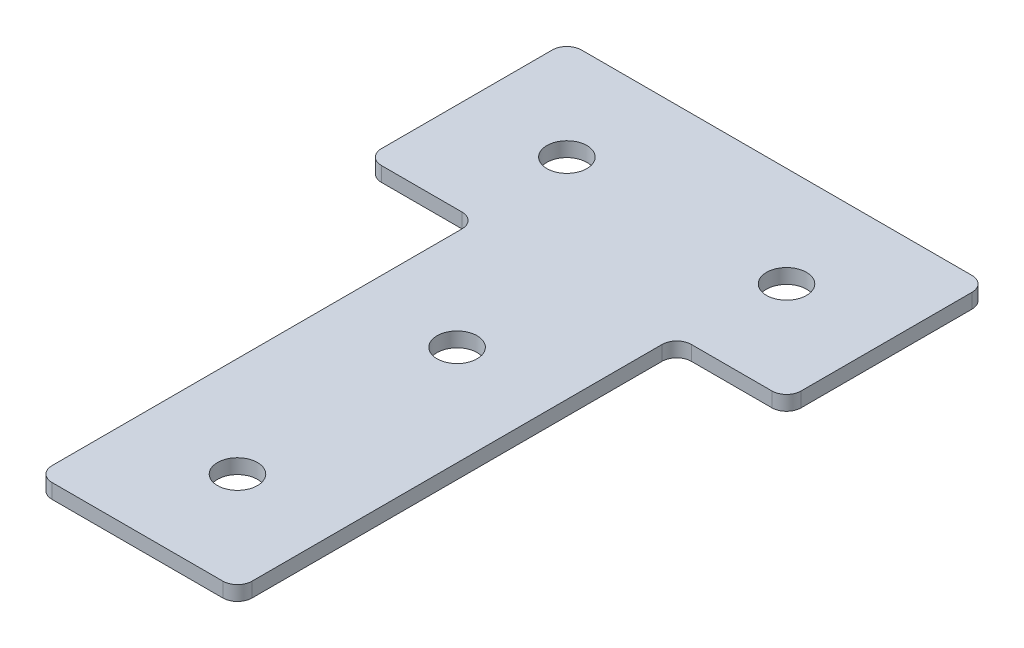
ISO-10303-21;
HEADER;
FILE_DESCRIPTION(('STEP AP214'),'2;1');
FILE_NAME('part.step','',(''),(''),'','','');
FILE_SCHEMA(('AUTOMOTIVE_DESIGN { 1 0 10303 214 1 1 1 1 }'));
ENDSEC;
DATA;
#1=APPLICATION_CONTEXT('core data for automotive mechanical design processes');
#2=APPLICATION_PROTOCOL_DEFINITION('international standard','automotive_design',2000,#1);
#3=PRODUCT_CONTEXT('',#1,'mechanical');
#4=PRODUCT('Part','Part','',(#3));
#5=PRODUCT_RELATED_PRODUCT_CATEGORY('part','',(#4));
#6=PRODUCT_DEFINITION_FORMATION('','',#4);
#7=PRODUCT_DEFINITION_CONTEXT('part definition',#1,'design');
#8=PRODUCT_DEFINITION('design','',#6,#7);
#9=PRODUCT_DEFINITION_SHAPE('','',#8);
#10=(LENGTH_UNIT() NAMED_UNIT(*) SI_UNIT(.MILLI.,.METRE.));
#11=(NAMED_UNIT(*) PLANE_ANGLE_UNIT() SI_UNIT($,.RADIAN.));
#12=(NAMED_UNIT(*) SI_UNIT($,.STERADIAN.) SOLID_ANGLE_UNIT());
#13=UNCERTAINTY_MEASURE_WITH_UNIT(LENGTH_MEASURE(1.E-05),#10,'distance_accuracy_value','');
#14=(GEOMETRIC_REPRESENTATION_CONTEXT(3) GLOBAL_UNCERTAINTY_ASSIGNED_CONTEXT((#13)) GLOBAL_UNIT_ASSIGNED_CONTEXT((#10,
#11,#12)) REPRESENTATION_CONTEXT('',''));
#15=CARTESIAN_POINT('',(0.,0.,0.));
#16=DIRECTION('',(0.,0.,1.));
#17=DIRECTION('',(1.,0.,0.));
#18=AXIS2_PLACEMENT_3D('',#15,#16,#17);
#19=CARTESIAN_POINT('',(-2.12462870860008,1.42462627726309,-45.7995222734962));
#20=DIRECTION('',(0.,-1.,0.));
#21=DIRECTION('',(0.,0.,-1.));
#22=AXIS2_PLACEMENT_3D('',#19,#20,#21);
#23=PLANE('',#22);
#24=CARTESIAN_POINT('',(-2.1246287086001,1.42462627726309,-0.799522273496195));
#25=DIRECTION('',(0.,1.,0.));
#26=DIRECTION('',(0.,0.,1.));
#27=AXIS2_PLACEMENT_3D('',#24,#25,#26);
#28=CIRCLE('',#27,4.1);
#29=CARTESIAN_POINT('',(-2.1246287086001,1.42462627726309,3.3004777265038));
#30=VERTEX_POINT('',#29);
#31=EDGE_CURVE('E207',#30,#30,#28,.T.);
#32=ORIENTED_EDGE('',*,*,#31,.T.);
#33=EDGE_LOOP('',(#32));
#34=FACE_BOUND('',#33,.T.);
#35=DIRECTION('',(1.,0.,0.));
#36=VECTOR('',#35,1.);
#37=CARTESIAN_POINT('',(-22.6246287086001,1.42462627726309,64.7004777265038));
#38=LINE('',#37,#36);
#39=CARTESIAN_POINT('',(-19.6246287086,1.42462627726309,64.7004777265038));
#40=VERTEX_POINT('',#39);
#41=CARTESIAN_POINT('',(15.3753712913999,1.42462627726309,64.7004777265038));
#42=VERTEX_POINT('',#41);
#43=EDGE_CURVE('E225',#40,#42,#38,.T.);
#44=ORIENTED_EDGE('',*,*,#43,.F.);
#45=CARTESIAN_POINT('',(-19.6246287086,1.42462627726309,61.7004777265038));
#46=DIRECTION('',(0.,1.,0.));
#47=DIRECTION('',(0.,0.,-1.));
#48=AXIS2_PLACEMENT_3D('',#45,#46,#47);
#49=CIRCLE('',#48,3.);
#50=CARTESIAN_POINT('',(-22.6246287086,1.42462627726309,61.7004777265038));
#51=VERTEX_POINT('',#50);
#52=EDGE_CURVE('E181',#51,#40,#49,.T.);
#53=ORIENTED_EDGE('',*,*,#52,.F.);
#54=DIRECTION('',(0.,0.,-1.));
#55=VECTOR('',#54,1.);
#56=CARTESIAN_POINT('',(-22.6246287086,1.42462627726309,64.7004777265038));
#57=LINE('',#56,#55);
#58=CARTESIAN_POINT('',(-22.6246287086001,1.42462627726309,-22.2995222734961));
#59=VERTEX_POINT('',#58);
#60=EDGE_CURVE('E296',#51,#59,#57,.T.);
#61=ORIENTED_EDGE('',*,*,#60,.T.);
#62=CARTESIAN_POINT('',(-25.6246287086001,1.42462627726309,-22.2995222734962));
#63=DIRECTION('',(0.,1.,0.));
#64=DIRECTION('',(0.,0.,-1.));
#65=AXIS2_PLACEMENT_3D('',#62,#63,#64);
#66=CIRCLE('',#65,3.);
#67=CARTESIAN_POINT('',(-25.6246287086001,1.42462627726309,-25.2995222734962));
#68=VERTEX_POINT('',#67);
#69=EDGE_CURVE('E197',#68,#59,#66,.F.);
#70=ORIENTED_EDGE('',*,*,#69,.F.);
#71=DIRECTION('',(-1.,0.,0.));
#72=VECTOR('',#71,1.);
#73=CARTESIAN_POINT('',(-22.6246287086001,1.42462627726309,-25.2995222734962));
#74=LINE('',#73,#72);
#75=CARTESIAN_POINT('',(-42.1246287086001,1.42462627726309,-25.2995222734962));
#76=VERTEX_POINT('',#75);
#77=EDGE_CURVE('E167',#68,#76,#74,.T.);
#78=ORIENTED_EDGE('',*,*,#77,.T.);
#79=CARTESIAN_POINT('',(-42.1246287086001,1.42462627726309,-28.2995222734962));
#80=DIRECTION('',(0.,1.,0.));
#81=DIRECTION('',(0.,0.,-1.));
#82=AXIS2_PLACEMENT_3D('',#79,#80,#81);
#83=CIRCLE('',#82,3.);
#84=CARTESIAN_POINT('',(-45.1246287086001,1.42462627726309,-28.2995222734962));
#85=VERTEX_POINT('',#84);
#86=EDGE_CURVE('E179',#85,#76,#83,.T.);
#87=ORIENTED_EDGE('',*,*,#86,.F.);
#88=DIRECTION('',(0.,0.,-1.));
#89=VECTOR('',#88,1.);
#90=CARTESIAN_POINT('',(-45.1246287086001,1.42462627726309,-25.2995222734962));
#91=LINE('',#90,#89);
#92=CARTESIAN_POINT('',(-45.1246287086001,1.42462627726309,-63.2995222734962));
#93=VERTEX_POINT('',#92);
#94=EDGE_CURVE('E147',#85,#93,#91,.T.);
#95=ORIENTED_EDGE('',*,*,#94,.T.);
#96=CARTESIAN_POINT('',(-42.1246287086001,1.42462627726309,-63.2995222734962));
#97=DIRECTION('',(0.,1.,0.));
#98=DIRECTION('',(0.,0.,-1.));
#99=AXIS2_PLACEMENT_3D('',#96,#97,#98);
#100=CIRCLE('',#99,3.);
#101=CARTESIAN_POINT('',(-42.1246287086001,1.42462627726309,-66.2995222734962));
#102=VERTEX_POINT('',#101);
#103=EDGE_CURVE('E176',#102,#93,#100,.T.);
#104=ORIENTED_EDGE('',*,*,#103,.F.);
#105=DIRECTION('',(-1.,0.,0.));
#106=VECTOR('',#105,1.);
#107=CARTESIAN_POINT('',(40.8753712913999,1.42462627726309,-66.2995222734962));
#108=LINE('',#107,#106);
#109=CARTESIAN_POINT('',(37.8753712913999,1.42462627726309,-66.2995222734962));
#110=VERTEX_POINT('',#109);
#111=EDGE_CURVE('E222',#110,#102,#108,.T.);
#112=ORIENTED_EDGE('',*,*,#111,.F.);
#113=CARTESIAN_POINT('',(37.8753712913999,1.42462627726309,-63.2995222734962));
#114=DIRECTION('',(0.,-1.,0.));
#115=DIRECTION('',(0.,0.,-1.));
#116=AXIS2_PLACEMENT_3D('',#113,#114,#115);
#117=CIRCLE('',#116,3.);
#118=CARTESIAN_POINT('',(40.8753712913999,1.42462627726309,-63.2995222734962));
#119=VERTEX_POINT('',#118);
#120=EDGE_CURVE('E252',#110,#119,#117,.T.);
#121=ORIENTED_EDGE('',*,*,#120,.T.);
#122=DIRECTION('',(0.,0.,-1.));
#123=VECTOR('',#122,1.);
#124=CARTESIAN_POINT('',(40.8753712913999,1.42462627726309,-25.2995222734962));
#125=LINE('',#124,#123);
#126=CARTESIAN_POINT('',(40.8753712913999,1.42462627726309,-28.2995222734962));
#127=VERTEX_POINT('',#126);
#128=EDGE_CURVE('E219',#127,#119,#125,.T.);
#129=ORIENTED_EDGE('',*,*,#128,.F.);
#130=CARTESIAN_POINT('',(37.8753712913999,1.42462627726309,-28.2995222734962));
#131=DIRECTION('',(0.,-1.,0.));
#132=DIRECTION('',(0.,0.,-1.));
#133=AXIS2_PLACEMENT_3D('',#130,#131,#132);
#134=CIRCLE('',#133,3.);
#135=CARTESIAN_POINT('',(37.8753712913999,1.42462627726309,-25.2995222734962));
#136=VERTEX_POINT('',#135);
#137=EDGE_CURVE('E254',#127,#136,#134,.T.);
#138=ORIENTED_EDGE('',*,*,#137,.T.);
#139=DIRECTION('',(1.,0.,0.));
#140=VECTOR('',#139,1.);
#141=CARTESIAN_POINT('',(18.3753712913999,1.42462627726309,-25.2995222734962));
#142=LINE('',#141,#140);
#143=CARTESIAN_POINT('',(21.3753712913999,1.42462627726309,-25.2995222734962));
#144=VERTEX_POINT('',#143);
#145=EDGE_CURVE('E229',#144,#136,#142,.T.);
#146=ORIENTED_EDGE('',*,*,#145,.F.);
#147=CARTESIAN_POINT('',(21.3753712913999,1.42462627726309,-22.2995222734962));
#148=DIRECTION('',(0.,-1.,0.));
#149=DIRECTION('',(0.,0.,-1.));
#150=AXIS2_PLACEMENT_3D('',#147,#148,#149);
#151=CIRCLE('',#150,3.);
#152=CARTESIAN_POINT('',(18.3753712913999,1.42462627726309,-22.2995222734961));
#153=VERTEX_POINT('',#152);
#154=EDGE_CURVE('E10',#144,#153,#151,.F.);
#155=ORIENTED_EDGE('',*,*,#154,.T.);
#156=DIRECTION('',(0.,0.,-1.));
#157=VECTOR('',#156,1.);
#158=CARTESIAN_POINT('',(18.3753712913999,1.42462627726309,64.7004777265038));
#159=LINE('',#158,#157);
#160=CARTESIAN_POINT('',(18.3753712913999,1.42462627726309,61.7004777265038));
#161=VERTEX_POINT('',#160);
#162=EDGE_CURVE('E227',#161,#153,#159,.T.);
#163=ORIENTED_EDGE('',*,*,#162,.F.);
#164=CARTESIAN_POINT('',(15.3753712913999,1.42462627726309,61.7004777265038));
#165=DIRECTION('',(0.,-1.,0.));
#166=DIRECTION('',(0.,0.,-1.));
#167=AXIS2_PLACEMENT_3D('',#164,#165,#166);
#168=CIRCLE('',#167,3.);
#169=EDGE_CURVE('E256',#161,#42,#168,.T.);
#170=ORIENTED_EDGE('',*,*,#169,.T.);
#171=EDGE_LOOP('',(#44,#53,#61,#70,#78,#87,#95,#104,#112,#121,#129,#138,#146,#155,#163,#170));
#172=FACE_BOUND('',#171,.T.);
#173=CARTESIAN_POINT('',(-2.1246287086001,1.42462627726309,44.2004777265038));
#174=DIRECTION('',(0.,1.,0.));
#175=DIRECTION('',(0.,0.,1.));
#176=AXIS2_PLACEMENT_3D('',#173,#174,#175);
#177=CIRCLE('',#176,4.1);
#178=CARTESIAN_POINT('',(-2.1246287086001,1.42462627726309,48.3004777265038));
#179=VERTEX_POINT('',#178);
#180=EDGE_CURVE('E201',#179,#179,#177,.T.);
#181=ORIENTED_EDGE('',*,*,#180,.T.);
#182=EDGE_LOOP('',(#181));
#183=FACE_BOUND('',#182,.T.);
#184=CARTESIAN_POINT('',(20.3753712913999,1.42462627726309,-45.7995222734962));
#185=DIRECTION('',(0.,1.,0.));
#186=DIRECTION('',(0.,0.,1.));
#187=AXIS2_PLACEMENT_3D('',#184,#185,#186);
#188=CIRCLE('',#187,4.1);
#189=CARTESIAN_POINT('',(20.3753712913999,1.42462627726309,-41.6995222734962));
#190=VERTEX_POINT('',#189);
#191=EDGE_CURVE('E213',#190,#190,#188,.T.);
#192=ORIENTED_EDGE('',*,*,#191,.T.);
#193=EDGE_LOOP('',(#192));
#194=FACE_BOUND('',#193,.T.);
#195=CARTESIAN_POINT('',(-24.6246287086001,1.42462627726309,-45.7995222734962));
#196=DIRECTION('',(0.,-1.,0.));
#197=DIRECTION('',(0.,0.,1.));
#198=AXIS2_PLACEMENT_3D('',#195,#196,#197);
#199=CIRCLE('',#198,4.1);
#200=CARTESIAN_POINT('',(-24.6246287086001,1.42462627726309,-41.6995222734962));
#201=VERTEX_POINT('',#200);
#202=EDGE_CURVE('E158',#201,#201,#199,.T.);
#203=ORIENTED_EDGE('',*,*,#202,.F.);
#204=EDGE_LOOP('',(#203));
#205=FACE_BOUND('',#204,.T.);
#206=ADVANCED_FACE('F16',(#34,#172,#183,#194,#205),#23,.T.);
#207=CARTESIAN_POINT('',(40.8753712913999,1.42462627726309,-25.2995222734962));
#208=DIRECTION('',(1.,0.,0.));
#209=DIRECTION('',(0.,0.,-1.));
#210=AXIS2_PLACEMENT_3D('',#207,#208,#209);
#211=PLANE('',#210);
#212=DIRECTION('',(0.,0.,-1.));
#213=VECTOR('',#212,1.);
#214=CARTESIAN_POINT('',(40.8753712913999,4.42462627726309,-25.2995222734962));
#215=LINE('',#214,#213);
#216=CARTESIAN_POINT('',(40.8753712913999,4.42462627726309,-28.2995222734962));
#217=VERTEX_POINT('',#216);
#218=CARTESIAN_POINT('',(40.8753712913999,4.42462627726309,-63.2995222734962));
#219=VERTEX_POINT('',#218);
#220=EDGE_CURVE('E216',#217,#219,#215,.T.);
#221=ORIENTED_EDGE('',*,*,#220,.F.);
#222=DIRECTION('',(0.,1.,0.));
#223=VECTOR('',#222,1.);
#224=CARTESIAN_POINT('',(40.8753712913999,1.42462627726309,-28.2995222734962));
#225=LINE('',#224,#223);
#226=EDGE_CURVE('E271',#217,#127,#225,.F.);
#227=ORIENTED_EDGE('',*,*,#226,.T.);
#228=ORIENTED_EDGE('',*,*,#128,.T.);
#229=DIRECTION('',(0.,1.,0.));
#230=VECTOR('',#229,1.);
#231=CARTESIAN_POINT('',(40.8753712913999,1.42462627726309,-63.2995222734962));
#232=LINE('',#231,#230);
#233=EDGE_CURVE('E268',#119,#219,#232,.T.);
#234=ORIENTED_EDGE('',*,*,#233,.T.);
#235=EDGE_LOOP('',(#221,#227,#228,#234));
#236=FACE_BOUND('',#235,.T.);
#237=ADVANCED_FACE('F323',(#236),#211,.T.);
#238=CARTESIAN_POINT('',(18.3753712913999,1.42462627726309,-25.2995222734962));
#239=DIRECTION('',(0.,0.,1.));
#240=DIRECTION('',(1.,0.,0.));
#241=AXIS2_PLACEMENT_3D('',#238,#239,#240);
#242=PLANE('',#241);
#243=DIRECTION('',(1.,0.,0.));
#244=VECTOR('',#243,1.);
#245=CARTESIAN_POINT('',(18.3753712913999,4.42462627726309,-25.2995222734962));
#246=LINE('',#245,#244);
#247=CARTESIAN_POINT('',(21.3753712913999,4.42462627726309,-25.2995222734962));
#248=VERTEX_POINT('',#247);
#249=CARTESIAN_POINT('',(37.8753712913999,4.42462627726309,-25.2995222734962));
#250=VERTEX_POINT('',#249);
#251=EDGE_CURVE('E223',#248,#250,#246,.T.);
#252=ORIENTED_EDGE('',*,*,#251,.F.);
#253=DIRECTION('',(0.,1.,0.));
#254=VECTOR('',#253,1.);
#255=CARTESIAN_POINT('',(21.3753712913999,1.42462627726309,-25.2995222734962));
#256=LINE('',#255,#254);
#257=EDGE_CURVE('E266',#248,#144,#256,.F.);
#258=ORIENTED_EDGE('',*,*,#257,.T.);
#259=ORIENTED_EDGE('',*,*,#145,.T.);
#260=DIRECTION('',(0.,1.,0.));
#261=VECTOR('',#260,1.);
#262=CARTESIAN_POINT('',(37.8753712913999,1.42462627726309,-25.2995222734962));
#263=LINE('',#262,#261);
#264=EDGE_CURVE('E263',#136,#250,#263,.T.);
#265=ORIENTED_EDGE('',*,*,#264,.T.);
#266=EDGE_LOOP('',(#252,#258,#259,#265));
#267=FACE_BOUND('',#266,.T.);
#268=ADVANCED_FACE('F279',(#267),#242,.T.);
#269=CARTESIAN_POINT('',(18.3753712913999,1.42462627726309,64.7004777265038));
#270=DIRECTION('',(1.,0.,0.));
#271=DIRECTION('',(0.,0.,-1.));
#272=AXIS2_PLACEMENT_3D('',#269,#270,#271);
#273=PLANE('',#272);
#274=DIRECTION('',(0.,0.,-1.));
#275=VECTOR('',#274,1.);
#276=CARTESIAN_POINT('',(18.3753712913999,4.42462627726309,64.7004777265038));
#277=LINE('',#276,#275);
#278=CARTESIAN_POINT('',(18.3753712913999,4.42462627726309,61.7004777265038));
#279=VERTEX_POINT('',#278);
#280=CARTESIAN_POINT('',(18.3753712913999,4.42462627726309,-22.2995222734961));
#281=VERTEX_POINT('',#280);
#282=EDGE_CURVE('E239',#279,#281,#277,.T.);
#283=ORIENTED_EDGE('',*,*,#282,.F.);
#284=DIRECTION('',(0.,1.,0.));
#285=VECTOR('',#284,1.);
#286=CARTESIAN_POINT('',(18.3753712913999,1.42462627726309,61.7004777265038));
#287=LINE('',#286,#285);
#288=EDGE_CURVE('E36',#279,#161,#287,.F.);
#289=ORIENTED_EDGE('',*,*,#288,.T.);
#290=ORIENTED_EDGE('',*,*,#162,.T.);
#291=DIRECTION('',(0.,1.,0.));
#292=VECTOR('',#291,1.);
#293=CARTESIAN_POINT('',(18.3753712913999,4.42462627726309,-22.2995222734962));
#294=LINE('',#293,#292);
#295=EDGE_CURVE('E259',#153,#281,#294,.T.);
#296=ORIENTED_EDGE('',*,*,#295,.T.);
#297=EDGE_LOOP('',(#283,#289,#290,#296));
#298=FACE_BOUND('',#297,.T.);
#299=ADVANCED_FACE('F282',(#298),#273,.T.);
#300=CARTESIAN_POINT('',(-22.6246287086001,1.42462627726309,64.7004777265038));
#301=DIRECTION('',(0.,0.,1.));
#302=DIRECTION('',(1.,0.,0.));
#303=AXIS2_PLACEMENT_3D('',#300,#301,#302);
#304=PLANE('',#303);
#305=DIRECTION('',(1.,0.,0.));
#306=VECTOR('',#305,1.);
#307=CARTESIAN_POINT('',(-22.6246287086001,4.42462627726309,64.7004777265038));
#308=LINE('',#307,#306);
#309=CARTESIAN_POINT('',(-19.6246287086,4.42462627726309,64.7004777265038));
#310=VERTEX_POINT('',#309);
#311=CARTESIAN_POINT('',(15.3753712913999,4.42462627726309,64.7004777265038));
#312=VERTEX_POINT('',#311);
#313=EDGE_CURVE('E237',#310,#312,#308,.T.);
#314=ORIENTED_EDGE('',*,*,#313,.F.);
#315=DIRECTION('',(0.,1.,0.));
#316=VECTOR('',#315,1.);
#317=CARTESIAN_POINT('',(-19.6246287086,1.42462627726309,64.7004777265038));
#318=LINE('',#317,#316);
#319=EDGE_CURVE('E173',#40,#310,#318,.T.);
#320=ORIENTED_EDGE('',*,*,#319,.F.);
#321=ORIENTED_EDGE('',*,*,#43,.T.);
#322=DIRECTION('',(0.,1.,0.));
#323=VECTOR('',#322,1.);
#324=CARTESIAN_POINT('',(15.3753712913999,1.42462627726309,64.7004777265038));
#325=LINE('',#324,#323);
#326=EDGE_CURVE('E249',#42,#312,#325,.T.);
#327=ORIENTED_EDGE('',*,*,#326,.T.);
#328=EDGE_LOOP('',(#314,#320,#321,#327));
#329=FACE_BOUND('',#328,.T.);
#330=ADVANCED_FACE('F290',(#329),#304,.T.);
#331=CARTESIAN_POINT('',(40.8753712913999,1.42462627726309,-66.2995222734962));
#332=DIRECTION('',(0.,0.,-1.));
#333=DIRECTION('',(-1.,0.,0.));
#334=AXIS2_PLACEMENT_3D('',#331,#332,#333);
#335=PLANE('',#334);
#336=ORIENTED_EDGE('',*,*,#111,.T.);
#337=DIRECTION('',(0.,1.,0.));
#338=VECTOR('',#337,1.);
#339=CARTESIAN_POINT('',(-42.1246287086001,1.42462627726309,-66.2995222734962));
#340=LINE('',#339,#338);
#341=CARTESIAN_POINT('',(-42.1246287086001,4.42462627726309,-66.2995222734962));
#342=VERTEX_POINT('',#341);
#343=EDGE_CURVE('E149',#342,#102,#340,.F.);
#344=ORIENTED_EDGE('',*,*,#343,.F.);
#345=DIRECTION('',(-1.,0.,0.));
#346=VECTOR('',#345,1.);
#347=CARTESIAN_POINT('',(40.8753712913999,4.42462627726309,-66.2995222734962));
#348=LINE('',#347,#346);
#349=CARTESIAN_POINT('',(37.8753712913999,4.42462627726309,-66.2995222734962));
#350=VERTEX_POINT('',#349);
#351=EDGE_CURVE('E235',#350,#342,#348,.T.);
#352=ORIENTED_EDGE('',*,*,#351,.F.);
#353=DIRECTION('',(0.,1.,0.));
#354=VECTOR('',#353,1.);
#355=CARTESIAN_POINT('',(37.8753712913999,1.42462627726309,-66.2995222734962));
#356=LINE('',#355,#354);
#357=EDGE_CURVE('E273',#350,#110,#356,.F.);
#358=ORIENTED_EDGE('',*,*,#357,.T.);
#359=EDGE_LOOP('',(#336,#344,#352,#358));
#360=FACE_BOUND('',#359,.T.);
#361=ADVANCED_FACE('F355',(#360),#335,.T.);
#362=CARTESIAN_POINT('',(-2.12462870860008,4.42462627726309,-45.7995222734962));
#363=DIRECTION('',(0.,-1.,0.));
#364=DIRECTION('',(0.,0.,-1.));
#365=AXIS2_PLACEMENT_3D('',#362,#363,#364);
#366=PLANE('',#365);
#367=CARTESIAN_POINT('',(-2.1246287086001,4.42462627726309,-0.799522273496195));
#368=DIRECTION('',(0.,1.,0.));
#369=DIRECTION('',(0.,0.,1.));
#370=AXIS2_PLACEMENT_3D('',#367,#368,#369);
#371=CIRCLE('',#370,4.1);
#372=CARTESIAN_POINT('',(-2.1246287086001,4.42462627726309,3.3004777265038));
#373=VERTEX_POINT('',#372);
#374=EDGE_CURVE('E204',#373,#373,#371,.T.);
#375=ORIENTED_EDGE('',*,*,#374,.F.);
#376=EDGE_LOOP('',(#375));
#377=FACE_BOUND('',#376,.T.);
#378=CARTESIAN_POINT('',(-19.6246287086,4.42462627726309,61.7004777265038));
#379=DIRECTION('',(0.,1.,0.));
#380=DIRECTION('',(0.,0.,-1.));
#381=AXIS2_PLACEMENT_3D('',#378,#379,#380);
#382=CIRCLE('',#381,3.);
#383=CARTESIAN_POINT('',(-22.6246287086,4.42462627726309,61.7004777265038));
#384=VERTEX_POINT('',#383);
#385=EDGE_CURVE('E139',#310,#384,#382,.F.);
#386=ORIENTED_EDGE('',*,*,#385,.F.);
#387=ORIENTED_EDGE('',*,*,#313,.T.);
#388=CARTESIAN_POINT('',(15.3753712913999,4.42462627726309,61.7004777265038));
#389=DIRECTION('',(0.,-1.,0.));
#390=DIRECTION('',(0.,0.,-1.));
#391=AXIS2_PLACEMENT_3D('',#388,#389,#390);
#392=CIRCLE('',#391,3.);
#393=EDGE_CURVE('E247',#312,#279,#392,.F.);
#394=ORIENTED_EDGE('',*,*,#393,.T.);
#395=ORIENTED_EDGE('',*,*,#282,.T.);
#396=CARTESIAN_POINT('',(21.3753712913999,4.42462627726309,-22.2995222734962));
#397=DIRECTION('',(0.,-1.,0.));
#398=DIRECTION('',(0.,0.,-1.));
#399=AXIS2_PLACEMENT_3D('',#396,#397,#398);
#400=CIRCLE('',#399,3.);
#401=EDGE_CURVE('E24',#281,#248,#400,.T.);
#402=ORIENTED_EDGE('',*,*,#401,.T.);
#403=ORIENTED_EDGE('',*,*,#251,.T.);
#404=CARTESIAN_POINT('',(37.8753712913999,4.42462627726309,-28.2995222734962));
#405=DIRECTION('',(0.,-1.,0.));
#406=DIRECTION('',(0.,0.,-1.));
#407=AXIS2_PLACEMENT_3D('',#404,#405,#406);
#408=CIRCLE('',#407,3.);
#409=EDGE_CURVE('E245',#250,#217,#408,.F.);
#410=ORIENTED_EDGE('',*,*,#409,.T.);
#411=ORIENTED_EDGE('',*,*,#220,.T.);
#412=CARTESIAN_POINT('',(37.8753712913999,4.42462627726309,-63.2995222734962));
#413=DIRECTION('',(0.,-1.,0.));
#414=DIRECTION('',(0.,0.,-1.));
#415=AXIS2_PLACEMENT_3D('',#412,#413,#414);
#416=CIRCLE('',#415,3.);
#417=EDGE_CURVE('E232',#219,#350,#416,.F.);
#418=ORIENTED_EDGE('',*,*,#417,.T.);
#419=ORIENTED_EDGE('',*,*,#351,.T.);
#420=CARTESIAN_POINT('',(-42.1246287086001,4.42462627726309,-63.2995222734962));
#421=DIRECTION('',(0.,1.,0.));
#422=DIRECTION('',(0.,0.,-1.));
#423=AXIS2_PLACEMENT_3D('',#420,#421,#422);
#424=CIRCLE('',#423,3.);
#425=CARTESIAN_POINT('',(-45.1246287086001,4.42462627726309,-63.2995222734962));
#426=VERTEX_POINT('',#425);
#427=EDGE_CURVE('E140',#426,#342,#424,.F.);
#428=ORIENTED_EDGE('',*,*,#427,.F.);
#429=DIRECTION('',(0.,0.,-1.));
#430=VECTOR('',#429,1.);
#431=CARTESIAN_POINT('',(-45.1246287086001,4.42462627726309,-25.2995222734962));
#432=LINE('',#431,#430);
#433=CARTESIAN_POINT('',(-45.1246287086001,4.42462627726309,-28.2995222734962));
#434=VERTEX_POINT('',#433);
#435=EDGE_CURVE('E145',#434,#426,#432,.T.);
#436=ORIENTED_EDGE('',*,*,#435,.F.);
#437=CARTESIAN_POINT('',(-42.1246287086001,4.42462627726309,-28.2995222734962));
#438=DIRECTION('',(0.,1.,0.));
#439=DIRECTION('',(0.,0.,-1.));
#440=AXIS2_PLACEMENT_3D('',#437,#438,#439);
#441=CIRCLE('',#440,3.);
#442=CARTESIAN_POINT('',(-42.1246287086001,4.42462627726309,-25.2995222734962));
#443=VERTEX_POINT('',#442);
#444=EDGE_CURVE('E128',#443,#434,#441,.F.);
#445=ORIENTED_EDGE('',*,*,#444,.F.);
#446=DIRECTION('',(-1.,0.,0.));
#447=VECTOR('',#446,1.);
#448=CARTESIAN_POINT('',(-22.6246287086001,4.42462627726309,-25.2995222734962));
#449=LINE('',#448,#447);
#450=CARTESIAN_POINT('',(-25.6246287086001,4.42462627726309,-25.2995222734962));
#451=VERTEX_POINT('',#450);
#452=EDGE_CURVE('E161',#451,#443,#449,.T.);
#453=ORIENTED_EDGE('',*,*,#452,.F.);
#454=CARTESIAN_POINT('',(-25.6246287086001,4.42462627726309,-22.2995222734962));
#455=DIRECTION('',(0.,1.,0.));
#456=DIRECTION('',(0.,0.,-1.));
#457=AXIS2_PLACEMENT_3D('',#454,#455,#456);
#458=CIRCLE('',#457,3.);
#459=CARTESIAN_POINT('',(-22.6246287086001,4.42462627726309,-22.2995222734961));
#460=VERTEX_POINT('',#459);
#461=EDGE_CURVE('E195',#460,#451,#458,.T.);
#462=ORIENTED_EDGE('',*,*,#461,.F.);
#463=DIRECTION('',(0.,0.,-1.));
#464=VECTOR('',#463,1.);
#465=CARTESIAN_POINT('',(-22.6246287086,4.42462627726309,64.7004777265038));
#466=LINE('',#465,#464);
#467=EDGE_CURVE('E157',#384,#460,#466,.T.);
#468=ORIENTED_EDGE('',*,*,#467,.F.);
#469=EDGE_LOOP('',(#386,#387,#394,#395,#402,#403,#410,#411,#418,#419,#428,#436,#445,#453,#462,#468));
#470=FACE_BOUND('',#469,.T.);
#471=CARTESIAN_POINT('',(-2.1246287086001,4.42462627726309,44.2004777265038));
#472=DIRECTION('',(0.,1.,0.));
#473=DIRECTION('',(0.,0.,1.));
#474=AXIS2_PLACEMENT_3D('',#471,#472,#473);
#475=CIRCLE('',#474,4.1);
#476=CARTESIAN_POINT('',(-2.1246287086001,4.42462627726309,48.3004777265038));
#477=VERTEX_POINT('',#476);
#478=EDGE_CURVE('E200',#477,#477,#475,.T.);
#479=ORIENTED_EDGE('',*,*,#478,.F.);
#480=EDGE_LOOP('',(#479));
#481=FACE_BOUND('',#480,.T.);
#482=CARTESIAN_POINT('',(20.3753712913999,4.42462627726309,-45.7995222734962));
#483=DIRECTION('',(0.,1.,0.));
#484=DIRECTION('',(0.,0.,1.));
#485=AXIS2_PLACEMENT_3D('',#482,#483,#484);
#486=CIRCLE('',#485,4.1);
#487=CARTESIAN_POINT('',(20.3753712913999,4.42462627726309,-41.6995222734962));
#488=VERTEX_POINT('',#487);
#489=EDGE_CURVE('E210',#488,#488,#486,.T.);
#490=ORIENTED_EDGE('',*,*,#489,.F.);
#491=EDGE_LOOP('',(#490));
#492=FACE_BOUND('',#491,.T.);
#493=CARTESIAN_POINT('',(-24.6246287086001,4.42462627726309,-45.7995222734962));
#494=DIRECTION('',(0.,-1.,0.));
#495=DIRECTION('',(0.,0.,1.));
#496=AXIS2_PLACEMENT_3D('',#493,#494,#495);
#497=CIRCLE('',#496,4.1);
#498=CARTESIAN_POINT('',(-24.6246287086001,4.42462627726309,-41.6995222734962));
#499=VERTEX_POINT('',#498);
#500=EDGE_CURVE('E164',#499,#499,#497,.T.);
#501=ORIENTED_EDGE('',*,*,#500,.T.);
#502=EDGE_LOOP('',(#501));
#503=FACE_BOUND('',#502,.T.);
#504=ADVANCED_FACE('F153',(#377,#470,#481,#492,#503),#366,.F.);
#505=CARTESIAN_POINT('',(15.3753712913999,1.42462627726309,61.7004777265038));
#506=DIRECTION('',(0.,1.,0.));
#507=DIRECTION('',(0.,0.,1.));
#508=AXIS2_PLACEMENT_3D('',#505,#506,#507);
#509=CYLINDRICAL_SURFACE('',#508,3.);
#510=ORIENTED_EDGE('',*,*,#169,.F.);
#511=ORIENTED_EDGE('',*,*,#288,.F.);
#512=ORIENTED_EDGE('',*,*,#393,.F.);
#513=ORIENTED_EDGE('',*,*,#326,.F.);
#514=EDGE_LOOP('',(#510,#511,#512,#513));
#515=FACE_BOUND('',#514,.T.);
#516=ADVANCED_FACE('F287',(#515),#509,.T.);
#517=CARTESIAN_POINT('',(21.3753712913999,1.42462627726309,-22.2995222734962));
#518=DIRECTION('',(0.,-1.,0.));
#519=DIRECTION('',(0.,0.,-1.));
#520=AXIS2_PLACEMENT_3D('',#517,#518,#519);
#521=CYLINDRICAL_SURFACE('',#520,3.);
#522=ORIENTED_EDGE('',*,*,#154,.F.);
#523=ORIENTED_EDGE('',*,*,#257,.F.);
#524=ORIENTED_EDGE('',*,*,#401,.F.);
#525=ORIENTED_EDGE('',*,*,#295,.F.);
#526=EDGE_LOOP('',(#522,#523,#524,#525));
#527=FACE_BOUND('',#526,.T.);
#528=ADVANCED_FACE('F281',(#527),#521,.F.);
#529=CARTESIAN_POINT('',(37.8753712913999,1.42462627726309,-28.2995222734962));
#530=DIRECTION('',(0.,1.,0.));
#531=DIRECTION('',(0.,0.,1.));
#532=AXIS2_PLACEMENT_3D('',#529,#530,#531);
#533=CYLINDRICAL_SURFACE('',#532,3.);
#534=ORIENTED_EDGE('',*,*,#137,.F.);
#535=ORIENTED_EDGE('',*,*,#226,.F.);
#536=ORIENTED_EDGE('',*,*,#409,.F.);
#537=ORIENTED_EDGE('',*,*,#264,.F.);
#538=EDGE_LOOP('',(#534,#535,#536,#537));
#539=FACE_BOUND('',#538,.T.);
#540=ADVANCED_FACE('F336',(#539),#533,.T.);
#541=CARTESIAN_POINT('',(37.8753712913999,1.42462627726309,-63.2995222734962));
#542=DIRECTION('',(0.,1.,0.));
#543=DIRECTION('',(0.,0.,1.));
#544=AXIS2_PLACEMENT_3D('',#541,#542,#543);
#545=CYLINDRICAL_SURFACE('',#544,3.);
#546=ORIENTED_EDGE('',*,*,#120,.F.);
#547=ORIENTED_EDGE('',*,*,#357,.F.);
#548=ORIENTED_EDGE('',*,*,#417,.F.);
#549=ORIENTED_EDGE('',*,*,#233,.F.);
#550=EDGE_LOOP('',(#546,#547,#548,#549));
#551=FACE_BOUND('',#550,.T.);
#552=ADVANCED_FACE('F18',(#551),#545,.T.);
#553=CARTESIAN_POINT('',(20.3753712913999,1.42462627726309,-45.7995222734962));
#554=DIRECTION('',(0.,1.,0.));
#555=DIRECTION('',(0.,0.,1.));
#556=AXIS2_PLACEMENT_3D('',#553,#554,#555);
#557=CYLINDRICAL_SURFACE('',#556,4.1);
#558=ORIENTED_EDGE('',*,*,#191,.F.);
#559=EDGE_LOOP('',(#558));
#560=FACE_BOUND('',#559,.T.);
#561=ORIENTED_EDGE('',*,*,#489,.T.);
#562=EDGE_LOOP('',(#561));
#563=FACE_BOUND('',#562,.T.);
#564=ADVANCED_FACE('F342',(#560,#563),#557,.F.);
#565=CARTESIAN_POINT('',(-2.1246287086001,1.42462627726309,-0.799522273496195));
#566=DIRECTION('',(0.,1.,0.));
#567=DIRECTION('',(0.,0.,1.));
#568=AXIS2_PLACEMENT_3D('',#565,#566,#567);
#569=CYLINDRICAL_SURFACE('',#568,4.1);
#570=ORIENTED_EDGE('',*,*,#31,.F.);
#571=EDGE_LOOP('',(#570));
#572=FACE_BOUND('',#571,.T.);
#573=ORIENTED_EDGE('',*,*,#374,.T.);
#574=EDGE_LOOP('',(#573));
#575=FACE_BOUND('',#574,.T.);
#576=ADVANCED_FACE('F376',(#572,#575),#569,.F.);
#577=CARTESIAN_POINT('',(-2.1246287086001,1.42462627726309,44.2004777265038));
#578=DIRECTION('',(0.,1.,0.));
#579=DIRECTION('',(0.,0.,1.));
#580=AXIS2_PLACEMENT_3D('',#577,#578,#579);
#581=CYLINDRICAL_SURFACE('',#580,4.1);
#582=ORIENTED_EDGE('',*,*,#478,.T.);
#583=EDGE_LOOP('',(#582));
#584=FACE_BOUND('',#583,.T.);
#585=ORIENTED_EDGE('',*,*,#180,.F.);
#586=EDGE_LOOP('',(#585));
#587=FACE_BOUND('',#586,.T.);
#588=ADVANCED_FACE('F373',(#584,#587),#581,.F.);
#589=CARTESIAN_POINT('',(-45.1246287086001,1.42462627726309,-25.2995222734962));
#590=DIRECTION('',(-1.,0.,0.));
#591=DIRECTION('',(0.,0.,-1.));
#592=AXIS2_PLACEMENT_3D('',#589,#590,#591);
#593=PLANE('',#592);
#594=ORIENTED_EDGE('',*,*,#435,.T.);
#595=DIRECTION('',(0.,1.,0.));
#596=VECTOR('',#595,1.);
#597=CARTESIAN_POINT('',(-45.1246287086001,1.42462627726309,-63.2995222734962));
#598=LINE('',#597,#596);
#599=EDGE_CURVE('E150',#93,#426,#598,.T.);
#600=ORIENTED_EDGE('',*,*,#599,.F.);
#601=ORIENTED_EDGE('',*,*,#94,.F.);
#602=DIRECTION('',(0.,1.,0.));
#603=VECTOR('',#602,1.);
#604=CARTESIAN_POINT('',(-45.1246287086001,1.42462627726309,-28.2995222734962));
#605=LINE('',#604,#603);
#606=EDGE_CURVE('E132',#434,#85,#605,.F.);
#607=ORIENTED_EDGE('',*,*,#606,.F.);
#608=EDGE_LOOP('',(#594,#600,#601,#607));
#609=FACE_BOUND('',#608,.T.);
#610=ADVANCED_FACE('F144',(#609),#593,.T.);
#611=CARTESIAN_POINT('',(-22.6246287086001,1.42462627726309,-25.2995222734962));
#612=DIRECTION('',(0.,0.,1.));
#613=DIRECTION('',(-1.,0.,0.));
#614=AXIS2_PLACEMENT_3D('',#611,#612,#613);
#615=PLANE('',#614);
#616=ORIENTED_EDGE('',*,*,#452,.T.);
#617=DIRECTION('',(0.,1.,0.));
#618=VECTOR('',#617,1.);
#619=CARTESIAN_POINT('',(-42.1246287086001,1.42462627726309,-25.2995222734962));
#620=LINE('',#619,#618);
#621=EDGE_CURVE('E134',#76,#443,#620,.T.);
#622=ORIENTED_EDGE('',*,*,#621,.F.);
#623=ORIENTED_EDGE('',*,*,#77,.F.);
#624=DIRECTION('',(0.,1.,0.));
#625=VECTOR('',#624,1.);
#626=CARTESIAN_POINT('',(-25.6246287086001,1.42462627726309,-25.2995222734962));
#627=LINE('',#626,#625);
#628=EDGE_CURVE('E190',#451,#68,#627,.F.);
#629=ORIENTED_EDGE('',*,*,#628,.F.);
#630=EDGE_LOOP('',(#616,#622,#623,#629));
#631=FACE_BOUND('',#630,.T.);
#632=ADVANCED_FACE('F360',(#631),#615,.T.);
#633=CARTESIAN_POINT('',(-22.6246287086,1.42462627726309,64.7004777265038));
#634=DIRECTION('',(-1.,0.,0.));
#635=DIRECTION('',(0.,0.,-1.));
#636=AXIS2_PLACEMENT_3D('',#633,#634,#635);
#637=PLANE('',#636);
#638=ORIENTED_EDGE('',*,*,#467,.T.);
#639=DIRECTION('',(0.,1.,0.));
#640=VECTOR('',#639,1.);
#641=CARTESIAN_POINT('',(-22.6246287086001,4.42462627726309,-22.2995222734962));
#642=LINE('',#641,#640);
#643=EDGE_CURVE('E184',#59,#460,#642,.T.);
#644=ORIENTED_EDGE('',*,*,#643,.F.);
#645=ORIENTED_EDGE('',*,*,#60,.F.);
#646=DIRECTION('',(0.,1.,0.));
#647=VECTOR('',#646,1.);
#648=CARTESIAN_POINT('',(-22.6246287086,1.42462627726309,61.7004777265038));
#649=LINE('',#648,#647);
#650=EDGE_CURVE('E187',#384,#51,#649,.F.);
#651=ORIENTED_EDGE('',*,*,#650,.F.);
#652=EDGE_LOOP('',(#638,#644,#645,#651));
#653=FACE_BOUND('',#652,.T.);
#654=ADVANCED_FACE('F302',(#653),#637,.T.);
#655=CARTESIAN_POINT('',(-19.6246287086,1.42462627726309,61.7004777265038));
#656=DIRECTION('',(0.,1.,0.));
#657=DIRECTION('',(0.,0.,1.));
#658=AXIS2_PLACEMENT_3D('',#655,#656,#657);
#659=CYLINDRICAL_SURFACE('',#658,3.);
#660=ORIENTED_EDGE('',*,*,#52,.T.);
#661=ORIENTED_EDGE('',*,*,#319,.T.);
#662=ORIENTED_EDGE('',*,*,#385,.T.);
#663=ORIENTED_EDGE('',*,*,#650,.T.);
#664=EDGE_LOOP('',(#660,#661,#662,#663));
#665=FACE_BOUND('',#664,.T.);
#666=ADVANCED_FACE('F298',(#665),#659,.T.);
#667=CARTESIAN_POINT('',(-25.6246287086001,1.42462627726309,-22.2995222734962));
#668=DIRECTION('',(0.,-1.,0.));
#669=DIRECTION('',(0.,0.,-1.));
#670=AXIS2_PLACEMENT_3D('',#667,#668,#669);
#671=CYLINDRICAL_SURFACE('',#670,3.);
#672=ORIENTED_EDGE('',*,*,#69,.T.);
#673=ORIENTED_EDGE('',*,*,#643,.T.);
#674=ORIENTED_EDGE('',*,*,#461,.T.);
#675=ORIENTED_EDGE('',*,*,#628,.T.);
#676=EDGE_LOOP('',(#672,#673,#674,#675));
#677=FACE_BOUND('',#676,.T.);
#678=ADVANCED_FACE('F362',(#677),#671,.F.);
#679=CARTESIAN_POINT('',(-42.1246287086001,1.42462627726309,-28.2995222734962));
#680=DIRECTION('',(0.,1.,0.));
#681=DIRECTION('',(0.,0.,1.));
#682=AXIS2_PLACEMENT_3D('',#679,#680,#681);
#683=CYLINDRICAL_SURFACE('',#682,3.);
#684=ORIENTED_EDGE('',*,*,#86,.T.);
#685=ORIENTED_EDGE('',*,*,#621,.T.);
#686=ORIENTED_EDGE('',*,*,#444,.T.);
#687=ORIENTED_EDGE('',*,*,#606,.T.);
#688=EDGE_LOOP('',(#684,#685,#686,#687));
#689=FACE_BOUND('',#688,.T.);
#690=ADVANCED_FACE('F131',(#689),#683,.T.);
#691=CARTESIAN_POINT('',(-42.1246287086001,1.42462627726309,-63.2995222734962));
#692=DIRECTION('',(0.,1.,0.));
#693=DIRECTION('',(0.,0.,1.));
#694=AXIS2_PLACEMENT_3D('',#691,#692,#693);
#695=CYLINDRICAL_SURFACE('',#694,3.);
#696=ORIENTED_EDGE('',*,*,#103,.T.);
#697=ORIENTED_EDGE('',*,*,#599,.T.);
#698=ORIENTED_EDGE('',*,*,#427,.T.);
#699=ORIENTED_EDGE('',*,*,#343,.T.);
#700=EDGE_LOOP('',(#696,#697,#698,#699));
#701=FACE_BOUND('',#700,.T.);
#702=ADVANCED_FACE('F312',(#701),#695,.T.);
#703=CARTESIAN_POINT('',(-24.6246287086001,1.42462627726309,-45.7995222734962));
#704=DIRECTION('',(0.,1.,0.));
#705=DIRECTION('',(0.,0.,1.));
#706=AXIS2_PLACEMENT_3D('',#703,#704,#705);
#707=CYLINDRICAL_SURFACE('',#706,4.1);
#708=ORIENTED_EDGE('',*,*,#202,.T.);
#709=EDGE_LOOP('',(#708));
#710=FACE_BOUND('',#709,.T.);
#711=ORIENTED_EDGE('',*,*,#500,.F.);
#712=EDGE_LOOP('',(#711));
#713=FACE_BOUND('',#712,.T.);
#714=ADVANCED_FACE('F310',(#710,#713),#707,.F.);
#715=CLOSED_SHELL('',(#206,#237,#268,#299,#330,#361,#504,#516,#528,#540,#552,#564,#576,#588,
#610,#632,#654,#666,#678,#690,#702,#714));
#716=MANIFOLD_SOLID_BREP('B1',#715);
#717=ADVANCED_BREP_SHAPE_REPRESENTATION('',(#18,#716),#14);
#718=SHAPE_DEFINITION_REPRESENTATION(#9,#717);
ENDSEC;
END-ISO-10303-21;
